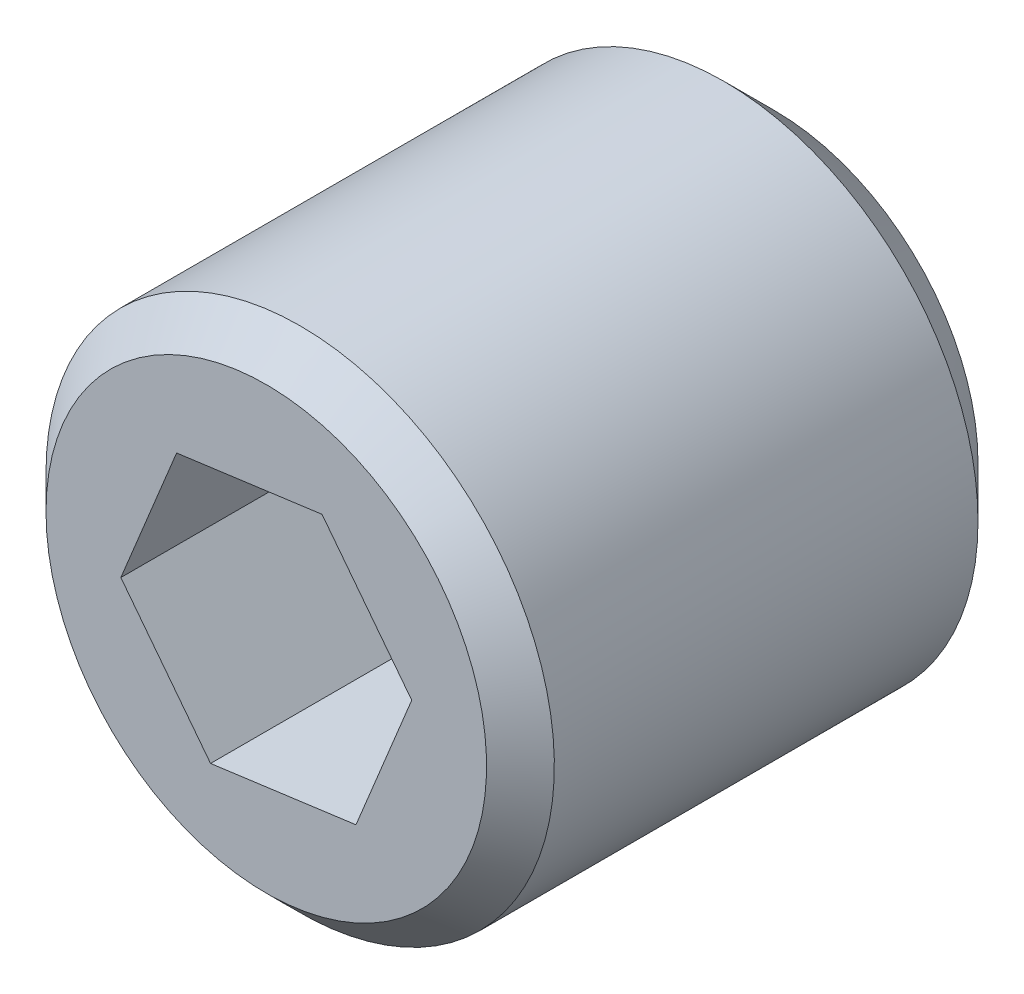
ISO-10303-21;
HEADER;
FILE_DESCRIPTION(('STEP AP214'),'2;1');
FILE_NAME('part.step','',(''),(''),'','','');
FILE_SCHEMA(('AUTOMOTIVE_DESIGN { 1 0 10303 214 1 1 1 1 }'));
ENDSEC;
DATA;
#1=APPLICATION_CONTEXT('core data for automotive mechanical design processes');
#2=APPLICATION_PROTOCOL_DEFINITION('international standard','automotive_design',2000,#1);
#3=PRODUCT_CONTEXT('',#1,'mechanical');
#4=PRODUCT('Part','Part','',(#3));
#5=PRODUCT_RELATED_PRODUCT_CATEGORY('part','',(#4));
#6=PRODUCT_DEFINITION_FORMATION('','',#4);
#7=PRODUCT_DEFINITION_CONTEXT('part definition',#1,'design');
#8=PRODUCT_DEFINITION('design','',#6,#7);
#9=PRODUCT_DEFINITION_SHAPE('','',#8);
#10=(LENGTH_UNIT() NAMED_UNIT(*) SI_UNIT(.MILLI.,.METRE.));
#11=(NAMED_UNIT(*) PLANE_ANGLE_UNIT() SI_UNIT($,.RADIAN.));
#12=(NAMED_UNIT(*) SI_UNIT($,.STERADIAN.) SOLID_ANGLE_UNIT());
#13=UNCERTAINTY_MEASURE_WITH_UNIT(LENGTH_MEASURE(1.E-05),#10,'distance_accuracy_value','');
#14=(GEOMETRIC_REPRESENTATION_CONTEXT(3) GLOBAL_UNCERTAINTY_ASSIGNED_CONTEXT((#13)) GLOBAL_UNIT_ASSIGNED_CONTEXT((#10,
#11,#12)) REPRESENTATION_CONTEXT('',''));
#15=CARTESIAN_POINT('',(0.,0.,0.));
#16=DIRECTION('',(0.,0.,1.));
#17=DIRECTION('',(1.,0.,0.));
#18=AXIS2_PLACEMENT_3D('',#15,#16,#17);
#19=CARTESIAN_POINT('',(-0.216609,-10.0653,143.246179594939));
#20=DIRECTION('',(0.,0.,1.));
#21=DIRECTION('',(1.,0.,0.));
#22=AXIS2_PLACEMENT_3D('',#19,#20,#21);
#23=CONICAL_SURFACE('',#22,0.871221663015082,1.22172999986979);
#24=CARTESIAN_POINT('',(-1.0748781925244,-10.1809459820458,143.244288308446));
#25=CARTESIAN_POINT('',(-1.06125431292545,-10.1477704203502,143.237759434665));
#26=CARTESIAN_POINT('',(-1.04758551035089,-10.1144854665435,143.231820315478));
#27=CARTESIAN_POINT('',(-1.02015903742311,-10.0476991566601,143.221371381029));
#28=CARTESIAN_POINT('',(-1.00640130608111,-10.0141976520693,143.216862683983));
#29=CARTESIAN_POINT('',(-0.978949640261533,-9.94734999487793,143.209570006385));
#30=CARTESIAN_POINT('',(-0.965256332591143,-9.91400536861803,143.206770120815));
#31=CARTESIAN_POINT('',(-0.937837698502683,-9.8472381471224,143.203014689557));
#32=CARTESIAN_POINT('',(-0.924112386021839,-9.81381558582527,143.202058452436));
#33=CARTESIAN_POINT('',(-0.896661761060151,-9.74697046323101,143.202058452436));
#34=CARTESIAN_POINT('',(-0.882936448579307,-9.71354790193387,143.203014689557));
#35=CARTESIAN_POINT('',(-0.855517814490847,-9.64678068043825,143.206770120815));
#36=CARTESIAN_POINT('',(-0.841824506820456,-9.61343605417835,143.209570006385));
#37=CARTESIAN_POINT('',(-0.814372841000876,-9.54658839698702,143.216862683983));
#38=CARTESIAN_POINT('',(-0.800615109658877,-9.5130868923962,143.221371381029));
#39=CARTESIAN_POINT('',(-0.77318863673109,-9.44630058251273,143.231820315477));
#40=CARTESIAN_POINT('',(-0.759519834156534,-9.4130156287061,143.237759434664));
#41=CARTESIAN_POINT('',(-0.745895954557587,-9.37984006701043,143.244288308445));
#42=B_SPLINE_CURVE_WITH_KNOTS('',3,(#24,#25,#26,#27,#28,#29,#30,#31,#32,#33,#34,#35,#36,#37,#38,
#39,#40,#41),.UNSPECIFIED.,.F.,.F.,(4,2,2,2,2,2,2,2,4),(0.,0.109371635123955,0.218828560696517,
0.327250511791547,0.435631792929203,0.544013074066857,0.652435025161883,0.761891950734451,
0.871263585858409),.UNSPECIFIED.);
#43=CARTESIAN_POINT('',(-1.07487819254782,-10.1809459820409,143.244288308454));
#44=VERTEX_POINT('',#43);
#45=CARTESIAN_POINT('',(-0.74589595455647,-9.37984006700973,143.244288308445));
#46=VERTEX_POINT('',#45);
#47=EDGE_CURVE('E127',#44,#46,#42,.T.);
#48=ORIENTED_EDGE('',*,*,#47,.F.);
#49=CARTESIAN_POINT('',(-0.545591237965808,-10.8664059150302,143.244288308444));
#50=CARTESIAN_POINT('',(-0.567510177379705,-10.8380195083514,143.237759434663));
#51=CARTESIAN_POINT('',(-0.58950139165287,-10.8095395011789,143.231820315476));
#52=CARTESIAN_POINT('',(-0.633626796173292,-10.752394323945,143.221371381028));
#53=CARTESIAN_POINT('',(-0.655761084543052,-10.7237290268087,143.216862683982));
#54=CARTESIAN_POINT('',(-0.699927020944636,-10.6665313582365,143.209570006383));
#55=CARTESIAN_POINT('',(-0.721957660530318,-10.6380002928019,143.206770120814));
#56=CARTESIAN_POINT('',(-0.766070453441611,-10.5808714483959,143.203014689556));
#57=CARTESIAN_POINT('',(-0.788152584344152,-10.5522736984638,143.202058452434));
#58=CARTESIAN_POINT('',(-0.832316846149229,-10.4950781985995,143.202058452435));
#59=CARTESIAN_POINT('',(-0.854398977051764,-10.4664804486674,143.203014689556));
#60=CARTESIAN_POINT('',(-0.898511769963041,-10.4093516042614,143.206770120814));
#61=CARTESIAN_POINT('',(-0.920542409548713,-10.3808205388268,143.209570006384));
#62=CARTESIAN_POINT('',(-0.964708345950273,-10.3236228702547,143.216862683983));
#63=CARTESIAN_POINT('',(-0.98684263432002,-10.2949575731185,143.221371381029));
#64=CARTESIAN_POINT('',(-1.03096803884042,-10.2378123958846,143.231820315478));
#65=CARTESIAN_POINT('',(-1.05295925311357,-10.2093323887121,143.237759434665));
#66=CARTESIAN_POINT('',(-1.07487819252745,-10.1809459820332,143.244288308446));
#67=B_SPLINE_CURVE_WITH_KNOTS('',3,(#49,#50,#51,#52,#53,#54,#55,#56,#57,#58,#59,#60,#61,#62,#63,
#64,#65,#66),.UNSPECIFIED.,.F.,.F.,(4,2,2,2,2,2,2,2,4),(0.,0.109371635124787,0.218828560698181,
0.327250511794016,0.435631792932479,0.544013074070927,0.652435025166747,0.761891950740136,
0.871263585864916),.UNSPECIFIED.);
#68=CARTESIAN_POINT('',(-0.545591237965233,-10.8664059150316,143.244288308445));
#69=VERTEX_POINT('',#68);
#70=EDGE_CURVE('E116',#69,#44,#67,.T.);
#71=ORIENTED_EDGE('',*,*,#70,.F.);
#72=CARTESIAN_POINT('',(0.312677954555563,-10.7507599329902,143.244288308445));
#73=CARTESIAN_POINT('',(0.27713513554306,-10.7555490880072,143.237759434664));
#74=CARTESIAN_POINT('',(0.241475118695687,-10.7603540346415,143.231820315477));
#75=CARTESIAN_POINT('',(0.169923241248183,-10.7699951672914,143.221371381029));
#76=CARTESIAN_POINT('',(0.13403122153678,-10.7748313747462,143.216862683983));
#77=CARTESIAN_POINT('',(0.0624136193163191,-10.7844813633657,143.209570006385));
#78=CARTESIAN_POINT('',(0.0266896720605924,-10.7892949241912,143.206770120815));
#79=CARTESIAN_POINT('',(-0.0448417549384666,-10.7989333012812,143.203014689557));
#80=CARTESIAN_POINT('',(-0.080649198321504,-10.8037581126464,143.202058452436));
#81=CARTESIAN_POINT('',(-0.15226408508758,-10.8134077353768,143.202058452436));
#82=CARTESIAN_POINT('',(-0.188071528470618,-10.818232546742,143.203014689557));
#83=CARTESIAN_POINT('',(-0.259602955469678,-10.827870923832,143.206770120815));
#84=CARTESIAN_POINT('',(-0.295326902725405,-10.8326844846575,143.209570006385));
#85=CARTESIAN_POINT('',(-0.366944504945868,-10.842334473277,143.216862683983));
#86=CARTESIAN_POINT('',(-0.402836524657273,-10.8471706807318,143.221371381029));
#87=CARTESIAN_POINT('',(-0.474388402104779,-10.8568118133817,143.231820315477));
#88=CARTESIAN_POINT('',(-0.510048418952153,-10.861616760016,143.237759434664));
#89=CARTESIAN_POINT('',(-0.545591237964658,-10.866405915033,143.244288308445));
#90=B_SPLINE_CURVE_WITH_KNOTS('',3,(#72,#73,#74,#75,#76,#77,#78,#79,#80,#81,#82,#83,#84,#85,#86,
#87,#88,#89),.UNSPECIFIED.,.F.,.F.,(4,2,2,2,2,2,2,2,4),(0.,0.109371635123184,0.218828560694977,
0.32725051178925,0.435631792926152,0.544013074063055,0.652435025157327,0.76189195072912,
0.871263585852304),.UNSPECIFIED.);
#91=CARTESIAN_POINT('',(0.312677954555834,-10.7507599329899,143.244288308445));
#92=VERTEX_POINT('',#91);
#93=EDGE_CURVE('E20',#92,#69,#90,.T.);
#94=ORIENTED_EDGE('',*,*,#93,.F.);
#95=CARTESIAN_POINT('',(0.641660192522805,-9.94965401795747,143.244288308445));
#96=CARTESIAN_POINT('',(0.628036312923876,-9.98282957965297,143.237759434664));
#97=CARTESIAN_POINT('',(0.614367510349339,-10.0161145334594,143.231820315477));
#98=CARTESIAN_POINT('',(0.586941037421592,-10.0829008433426,143.221371381029));
#99=CARTESIAN_POINT('',(0.573183306079613,-10.1164023479332,143.216862683983));
#100=CARTESIAN_POINT('',(0.545731640260072,-10.1832500051242,143.209570006384));
#101=CARTESIAN_POINT('',(0.532038332589701,-10.2165946313839,143.206770120814));
#102=CARTESIAN_POINT('',(0.504619698501278,-10.2833618528792,143.203014689556));
#103=CARTESIAN_POINT('',(0.490894386020452,-10.3167844141762,143.202058452435));
#104=CARTESIAN_POINT('',(0.463443761058801,-10.3836295367701,143.202058452435));
#105=CARTESIAN_POINT('',(0.449718448577976,-10.4170520980671,143.203014689556));
#106=CARTESIAN_POINT('',(0.422299814489554,-10.4838193195623,143.206770120814));
#107=CARTESIAN_POINT('',(0.408606506819183,-10.5171639458221,143.209570006384));
#108=CARTESIAN_POINT('',(0.381154840999643,-10.5840116030131,143.216862683983));
#109=CARTESIAN_POINT('',(0.367397109657665,-10.6175131076037,143.221371381029));
#110=CARTESIAN_POINT('',(0.339970636729919,-10.6842994174868,143.231820315477));
#111=CARTESIAN_POINT('',(0.326301834155381,-10.7175843712933,143.237759434664));
#112=CARTESIAN_POINT('',(0.312677954556452,-10.7507599329888,143.244288308445));
#113=B_SPLINE_CURVE_WITH_KNOTS('',3,(#95,#96,#97,#98,#99,#100,#101,#102,#103,#104,#105,#106,
#107,#108,#109,#110,#111,#112),.UNSPECIFIED.,.F.,.F.,(4,2,2,2,2,2,2,2,4),(0.,0.109371635123448,
0.218828560695504,0.327250511790039,0.435631792927202,0.544013074064363,0.652435025158893,
0.761891950730948,0.871263585854398),.UNSPECIFIED.);
#114=CARTESIAN_POINT('',(0.641660192523404,-9.94965401795723,143.244288308445));
#115=VERTEX_POINT('',#114);
#116=EDGE_CURVE('E160',#115,#92,#113,.T.);
#117=ORIENTED_EDGE('',*,*,#116,.F.);
#118=CARTESIAN_POINT('',(0.112373237967538,-9.26419408496669,143.244288308446));
#119=CARTESIAN_POINT('',(0.134292177381183,-9.29258049164525,143.237759434665));
#120=CARTESIAN_POINT('',(0.156283391654093,-9.32106049881739,143.231820315478));
#121=CARTESIAN_POINT('',(0.200408796174002,-9.37820567605065,143.221371381029));
#122=CARTESIAN_POINT('',(0.222543084543503,-9.40687097318661,143.216862683983));
#123=CARTESIAN_POINT('',(0.266709020944575,-9.4640686417581,143.209570006385));
#124=CARTESIAN_POINT('',(0.288739660530005,-9.49259970719238,143.206770120815));
#125=CARTESIAN_POINT('',(0.332852453440793,-9.54972855159774,143.203014689557));
#126=CARTESIAN_POINT('',(0.354934584343083,-9.57832630152954,143.202058452436));
#127=CARTESIAN_POINT('',(0.399098846147664,-9.63552180139312,143.202058452436));
#128=CARTESIAN_POINT('',(0.421180977049954,-9.66411955132492,143.203014689557));
#129=CARTESIAN_POINT('',(0.465293769960747,-9.72124839573029,143.206770120815));
#130=CARTESIAN_POINT('',(0.487324409546179,-9.74977946116457,143.209570006385));
#131=CARTESIAN_POINT('',(0.531490345947257,-9.80697712973607,143.216862683983));
#132=CARTESIAN_POINT('',(0.553624634316762,-9.83564242687203,143.221371381029));
#133=CARTESIAN_POINT('',(0.597750038836677,-9.89278760410531,143.231820315477));
#134=CARTESIAN_POINT('',(0.619741253109589,-9.92126761127744,143.237759434664));
#135=CARTESIAN_POINT('',(0.641660192523238,-9.94965401795601,143.244288308445));
#136=B_SPLINE_CURVE_WITH_KNOTS('',3,(#118,#119,#120,#121,#122,#123,#124,#125,#126,#127,#128,
#129,#130,#131,#132,#133,#134,#135),.UNSPECIFIED.,.F.,.F.,(4,2,2,2,2,2,2,2,4),(0.,
0.109371635123523,0.218828560695651,0.327250511790259,0.435631792927495,0.544013074064732,
0.652435025159343,0.76189195073148,0.871263585854998),.UNSPECIFIED.);
#137=CARTESIAN_POINT('',(0.11237323796683,-9.2641940849668,143.244288308445));
#138=VERTEX_POINT('',#137);
#139=EDGE_CURVE('E142',#138,#115,#136,.T.);
#140=ORIENTED_EDGE('',*,*,#139,.F.);
#141=CARTESIAN_POINT('',(-0.745895954555732,-9.37984006700996,143.244288308445));
#142=CARTESIAN_POINT('',(-0.710353135543191,-9.37505091199298,143.237759434664));
#143=CARTESIAN_POINT('',(-0.67469311869578,-9.37024596535861,143.231820315477));
#144=CARTESIAN_POINT('',(-0.603141241248194,-9.36060483270869,143.221371381029));
#145=CARTESIAN_POINT('',(-0.567249221536748,-9.35576862525396,143.216862683983));
#146=CARTESIAN_POINT('',(-0.495631619316204,-9.34611863663439,143.209570006385));
#147=CARTESIAN_POINT('',(-0.459907672060437,-9.3413050758089,143.206770120815));
#148=CARTESIAN_POINT('',(-0.388376245061295,-9.3316666987189,143.203014689557));
#149=CARTESIAN_POINT('',(-0.352568801678215,-9.32684188735369,143.202058452436));
#150=CARTESIAN_POINT('',(-0.280953914912055,-9.31719226462327,143.202058452436));
#151=CARTESIAN_POINT('',(-0.245146471528976,-9.31236745325807,143.203014689557));
#152=CARTESIAN_POINT('',(-0.173615044529834,-9.30272907616806,143.206770120815));
#153=CARTESIAN_POINT('',(-0.137891097274067,-9.29791551534258,143.209570006385));
#154=CARTESIAN_POINT('',(-0.0662734950535236,-9.28826552672301,143.216862683983));
#155=CARTESIAN_POINT('',(-0.0303814753420776,-9.28342931926828,143.221371381029));
#156=CARTESIAN_POINT('',(0.0411704021055082,-9.27378818661835,143.231820315477));
#157=CARTESIAN_POINT('',(0.0768304189529203,-9.26898323998398,143.237759434664));
#158=CARTESIAN_POINT('',(0.112373237965461,-9.264194084967,143.244288308445));
#159=B_SPLINE_CURVE_WITH_KNOTS('',3,(#141,#142,#143,#144,#145,#146,#147,#148,#149,#150,#151,
#152,#153,#154,#155,#156,#157,#158),.UNSPECIFIED.,.F.,.F.,(4,2,2,2,2,2,2,2,4),(0.,
0.109371635123305,0.218828560695224,0.327250511789623,0.435631792926651,0.544013074063679,
0.652435025158078,0.761891950729996,0.871263585853302),.UNSPECIFIED.);
#160=EDGE_CURVE('E135',#46,#138,#159,.T.);
#161=ORIENTED_EDGE('',*,*,#160,.F.);
#162=EDGE_LOOP('',(#48,#71,#94,#117,#140,#161));
#163=FACE_BOUND('',#162,.T.);
#164=CARTESIAN_POINT('',(-0.216609,-10.0653,142.929080371996));
#165=VERTEX_POINT('',#164);
#166=VERTEX_LOOP('',#165);
#167=FACE_BOUND('',#166,.T.);
#168=ADVANCED_FACE('F16',(#163,#167),#23,.F.);
#169=CARTESIAN_POINT('',(0.312677954557,-10.75075993299,152.63));
#170=DIRECTION('',(-0.133536477726964,0.991043898682735,0.));
#171=DIRECTION('',(-0.991043898682735,-0.133536477726964,0.));
#172=AXIS2_PLACEMENT_3D('',#169,#170,#171);
#173=PLANE('',#172);
#174=ORIENTED_EDGE('',*,*,#93,.T.);
#175=DIRECTION('',(0.,0.,1.));
#176=VECTOR('',#175,1.);
#177=CARTESIAN_POINT('',(-0.545591237966,-10.86640591503,152.63));
#178=LINE('',#177,#176);
#179=CARTESIAN_POINT('',(-0.54559123796558,-10.8664059150305,144.63));
#180=VERTEX_POINT('',#179);
#181=EDGE_CURVE('E124',#180,#69,#178,.F.);
#182=ORIENTED_EDGE('',*,*,#181,.F.);
#183=DIRECTION('',(0.991043898683224,0.133536477723335,0.));
#184=VECTOR('',#183,1.);
#185=CARTESIAN_POINT('',(-0.545591237966,-10.86640591503,144.63));
#186=LINE('',#185,#184);
#187=CARTESIAN_POINT('',(0.312677954556633,-10.7507599329899,144.63));
#188=VERTEX_POINT('',#187);
#189=EDGE_CURVE('E203',#180,#188,#186,.T.);
#190=ORIENTED_EDGE('',*,*,#189,.T.);
#191=DIRECTION('',(0.,0.,1.));
#192=VECTOR('',#191,1.);
#193=CARTESIAN_POINT('',(0.312677954556107,-10.7507599329896,152.63));
#194=LINE('',#193,#192);
#195=EDGE_CURVE('E165',#92,#188,#194,.T.);
#196=ORIENTED_EDGE('',*,*,#195,.F.);
#197=EDGE_LOOP('',(#174,#182,#190,#196));
#198=FACE_BOUND('',#197,.T.);
#199=ADVANCED_FACE('F73',(#198),#173,.T.);
#200=CARTESIAN_POINT('',(0.641660192523,-9.949654017957,152.63));
#201=DIRECTION('',(-0.925037431388231,0.379875967298095,0.));
#202=DIRECTION('',(-0.379875967298095,-0.925037431388231,0.));
#203=AXIS2_PLACEMENT_3D('',#200,#201,#202);
#204=PLANE('',#203);
#205=ORIENTED_EDGE('',*,*,#116,.T.);
#206=ORIENTED_EDGE('',*,*,#195,.T.);
#207=DIRECTION('',(0.379875967297469,0.925037431388488,0.));
#208=VECTOR('',#207,1.);
#209=CARTESIAN_POINT('',(0.312677954557,-10.75075993299,144.63));
#210=LINE('',#209,#208);
#211=CARTESIAN_POINT('',(0.641660192523438,-9.94965401795742,144.63));
#212=VERTEX_POINT('',#211);
#213=EDGE_CURVE('E205',#188,#212,#210,.T.);
#214=ORIENTED_EDGE('',*,*,#213,.T.);
#215=DIRECTION('',(0.,0.,1.));
#216=VECTOR('',#215,1.);
#217=CARTESIAN_POINT('',(0.641660192524003,-9.949654017957,152.63));
#218=LINE('',#217,#216);
#219=EDGE_CURVE('E141',#115,#212,#218,.T.);
#220=ORIENTED_EDGE('',*,*,#219,.F.);
#221=EDGE_LOOP('',(#205,#206,#214,#220));
#222=FACE_BOUND('',#221,.T.);
#223=ADVANCED_FACE('F79',(#222),#204,.T.);
#224=CARTESIAN_POINT('',(0.112373237967,-9.264194084966,152.63));
#225=DIRECTION('',(-0.791500953661979,-0.611167931383984,0.));
#226=DIRECTION('',(0.611167931383984,-0.791500953661979,0.));
#227=AXIS2_PLACEMENT_3D('',#224,#225,#226);
#228=PLANE('',#227);
#229=ORIENTED_EDGE('',*,*,#139,.T.);
#230=ORIENTED_EDGE('',*,*,#219,.T.);
#231=DIRECTION('',(-0.611167931382699,0.791500953662971,0.));
#232=VECTOR('',#231,1.);
#233=CARTESIAN_POINT('',(0.641660192523,-9.949654017958,144.63));
#234=LINE('',#233,#232);
#235=CARTESIAN_POINT('',(0.112373237966439,-9.26419408496647,144.63));
#236=VERTEX_POINT('',#235);
#237=EDGE_CURVE('E209',#212,#236,#234,.T.);
#238=ORIENTED_EDGE('',*,*,#237,.T.);
#239=DIRECTION('',(0.,0.,1.));
#240=VECTOR('',#239,1.);
#241=CARTESIAN_POINT('',(0.112373237966124,-9.26419408496692,152.63));
#242=LINE('',#241,#240);
#243=EDGE_CURVE('E134',#138,#236,#242,.T.);
#244=ORIENTED_EDGE('',*,*,#243,.F.);
#245=EDGE_LOOP('',(#229,#230,#238,#244));
#246=FACE_BOUND('',#245,.T.);
#247=ADVANCED_FACE('F150',(#246),#228,.T.);
#248=CARTESIAN_POINT('',(-0.745895954556,-9.37984006701,152.63));
#249=DIRECTION('',(0.133536477726964,-0.991043898682735,0.));
#250=DIRECTION('',(0.991043898682735,0.133536477726964,0.));
#251=AXIS2_PLACEMENT_3D('',#248,#249,#250);
#252=PLANE('',#251);
#253=ORIENTED_EDGE('',*,*,#160,.T.);
#254=ORIENTED_EDGE('',*,*,#243,.T.);
#255=DIRECTION('',(-0.991043898682613,-0.13353647772787,0.));
#256=VECTOR('',#255,1.);
#257=CARTESIAN_POINT('',(0.112373237967,-9.264194084966,144.63));
#258=LINE('',#257,#256);
#259=CARTESIAN_POINT('',(-0.745895954556603,-9.37984006700975,144.63));
#260=VERTEX_POINT('',#259);
#261=EDGE_CURVE('E197',#236,#260,#258,.T.);
#262=ORIENTED_EDGE('',*,*,#261,.T.);
#263=DIRECTION('',(0.,0.,1.));
#264=VECTOR('',#263,1.);
#265=CARTESIAN_POINT('',(-0.745895954557205,-9.37984006700951,152.63));
#266=LINE('',#265,#264);
#267=EDGE_CURVE('E133',#46,#260,#266,.T.);
#268=ORIENTED_EDGE('',*,*,#267,.F.);
#269=EDGE_LOOP('',(#253,#254,#262,#268));
#270=FACE_BOUND('',#269,.T.);
#271=ADVANCED_FACE('F147',(#270),#252,.T.);
#272=CARTESIAN_POINT('',(-1.074878192522,-10.18094598204,152.63));
#273=DIRECTION('',(0.925037431388727,-0.379875967296888,0.));
#274=DIRECTION('',(0.379875967296888,0.925037431388727,0.));
#275=AXIS2_PLACEMENT_3D('',#272,#273,#274);
#276=PLANE('',#275);
#277=ORIENTED_EDGE('',*,*,#47,.T.);
#278=ORIENTED_EDGE('',*,*,#267,.T.);
#279=DIRECTION('',(-0.37987596729828,-0.925037431388155,0.));
#280=VECTOR('',#279,1.);
#281=CARTESIAN_POINT('',(-0.745895954556,-9.37984006701,144.63));
#282=LINE('',#281,#280);
#283=CARTESIAN_POINT('',(-1.07487819252214,-10.1809459820401,144.63));
#284=VERTEX_POINT('',#283);
#285=EDGE_CURVE('E38',#260,#284,#282,.T.);
#286=ORIENTED_EDGE('',*,*,#285,.T.);
#287=DIRECTION('',(0.,0.,1.));
#288=VECTOR('',#287,1.);
#289=CARTESIAN_POINT('',(-1.07487819252214,-10.1809459820401,152.63));
#290=LINE('',#289,#288);
#291=EDGE_CURVE('E123',#44,#284,#290,.T.);
#292=ORIENTED_EDGE('',*,*,#291,.F.);
#293=EDGE_LOOP('',(#277,#278,#286,#292));
#294=FACE_BOUND('',#293,.T.);
#295=ADVANCED_FACE('F111',(#294),#276,.T.);
#296=CARTESIAN_POINT('',(-0.545591237966,-10.86640591503,152.63));
#297=DIRECTION('',(0.791500953661979,0.611167931383984,0.));
#298=DIRECTION('',(-0.611167931383984,0.791500953661979,0.));
#299=AXIS2_PLACEMENT_3D('',#296,#297,#298);
#300=PLANE('',#299);
#301=ORIENTED_EDGE('',*,*,#70,.T.);
#302=ORIENTED_EDGE('',*,*,#291,.T.);
#303=DIRECTION('',(0.611167931383816,-0.791500953662108,0.));
#304=VECTOR('',#303,1.);
#305=CARTESIAN_POINT('',(-1.074878192522,-10.18094598204,144.63));
#306=LINE('',#305,#304);
#307=EDGE_CURVE('E174',#284,#180,#306,.T.);
#308=ORIENTED_EDGE('',*,*,#307,.T.);
#309=ORIENTED_EDGE('',*,*,#181,.T.);
#310=EDGE_LOOP('',(#301,#302,#308,#309));
#311=FACE_BOUND('',#310,.T.);
#312=ADVANCED_FACE('F106',(#311),#300,.T.);
#313=CARTESIAN_POINT('',(-0.216609,-10.0653,144.63));
#314=DIRECTION('',(0.,0.,-1.));
#315=DIRECTION('',(0.,1.,0.));
#316=AXIS2_PLACEMENT_3D('',#313,#314,#315);
#317=PLANE('',#316);
#318=ORIENTED_EDGE('',*,*,#285,.F.);
#319=ORIENTED_EDGE('',*,*,#261,.F.);
#320=ORIENTED_EDGE('',*,*,#237,.F.);
#321=ORIENTED_EDGE('',*,*,#213,.F.);
#322=ORIENTED_EDGE('',*,*,#189,.F.);
#323=ORIENTED_EDGE('',*,*,#307,.F.);
#324=EDGE_LOOP('',(#318,#319,#320,#321,#322,#323));
#325=FACE_BOUND('',#324,.T.);
#326=CARTESIAN_POINT('',(-0.216609,-10.0653,144.630000000063));
#327=DIRECTION('',(0.,0.,-1.));
#328=DIRECTION('',(-1.,0.,0.));
#329=AXIS2_PLACEMENT_3D('',#326,#327,#328);
#330=CIRCLE('',#329,1.30000000000693);
#331=CARTESIAN_POINT('',(-1.51660900000693,-10.0653,144.630000000063));
#332=VERTEX_POINT('',#331);
#333=EDGE_CURVE('E125',#332,#332,#330,.T.);
#334=ORIENTED_EDGE('',*,*,#333,.F.);
#335=EDGE_LOOP('',(#334));
#336=FACE_BOUND('',#335,.T.);
#337=ADVANCED_FACE('F102',(#325,#336),#317,.F.);
#338=CARTESIAN_POINT('',(-0.216609,-10.0653,141.63));
#339=DIRECTION('',(0.,0.,-1.));
#340=DIRECTION('',(0.,1.,0.));
#341=AXIS2_PLACEMENT_3D('',#338,#339,#340);
#342=PLANE('',#341);
#343=CARTESIAN_POINT('',(-0.216609,-10.0653,141.629999999958));
#344=DIRECTION('',(0.,0.,1.));
#345=DIRECTION('',(1.,0.,0.));
#346=AXIS2_PLACEMENT_3D('',#343,#344,#345);
#347=CIRCLE('',#346,1.19999999996689);
#348=CARTESIAN_POINT('',(0.98339099996689,-10.0653,141.629999999958));
#349=VERTEX_POINT('',#348);
#350=EDGE_CURVE('E217',#349,#349,#347,.T.);
#351=ORIENTED_EDGE('',*,*,#350,.F.);
#352=EDGE_LOOP('',(#351));
#353=FACE_BOUND('',#352,.T.);
#354=ADVANCED_FACE('F98',(#353),#342,.T.);
#355=CARTESIAN_POINT('',(-0.216609,-10.0653,144.43));
#356=DIRECTION('',(0.,0.,-1.));
#357=DIRECTION('',(-1.,0.,0.));
#358=AXIS2_PLACEMENT_3D('',#355,#356,#357);
#359=CONICAL_SURFACE('',#358,1.5000000000205,0.785398163272682);
#360=ORIENTED_EDGE('',*,*,#333,.T.);
#361=EDGE_LOOP('',(#360));
#362=FACE_BOUND('',#361,.T.);
#363=CARTESIAN_POINT('',(-0.216609,-10.0653,144.43));
#364=DIRECTION('',(0.,0.,-1.));
#365=DIRECTION('',(0.,1.,0.));
#366=AXIS2_PLACEMENT_3D('',#363,#364,#365);
#367=CIRCLE('',#366,1.5);
#368=CARTESIAN_POINT('',(-0.216609,-8.5653,144.43));
#369=VERTEX_POINT('',#368);
#370=EDGE_CURVE('E29',#369,#369,#367,.T.);
#371=ORIENTED_EDGE('',*,*,#370,.F.);
#372=EDGE_LOOP('',(#371));
#373=FACE_BOUND('',#372,.T.);
#374=ADVANCED_FACE('F90',(#362,#373),#359,.T.);
#375=CARTESIAN_POINT('',(-0.216609,-10.0653,141.929999999888));
#376=DIRECTION('',(0.,0.,1.));
#377=DIRECTION('',(1.,0.,0.));
#378=AXIS2_PLACEMENT_3D('',#375,#376,#377);
#379=CONICAL_SURFACE('',#378,1.49999999990594,0.785398163412051);
#380=CARTESIAN_POINT('',(-0.216609,-10.0653,141.93));
#381=DIRECTION('',(0.,0.,-1.));
#382=DIRECTION('',(0.,1.,0.));
#383=AXIS2_PLACEMENT_3D('',#380,#381,#382);
#384=CIRCLE('',#383,1.5);
#385=CARTESIAN_POINT('',(-0.216609,-8.5653,141.93));
#386=VERTEX_POINT('',#385);
#387=EDGE_CURVE('E11',#386,#386,#384,.F.);
#388=ORIENTED_EDGE('',*,*,#387,.F.);
#389=EDGE_LOOP('',(#388));
#390=FACE_BOUND('',#389,.T.);
#391=ORIENTED_EDGE('',*,*,#350,.T.);
#392=EDGE_LOOP('',(#391));
#393=FACE_BOUND('',#392,.T.);
#394=ADVANCED_FACE('F84',(#390,#393),#379,.T.);
#395=CARTESIAN_POINT('',(-0.216609,-10.0653,144.63));
#396=DIRECTION('',(0.,0.,-1.));
#397=DIRECTION('',(0.,1.,0.));
#398=AXIS2_PLACEMENT_3D('',#395,#396,#397);
#399=CYLINDRICAL_SURFACE('',#398,1.5);
#400=ORIENTED_EDGE('',*,*,#370,.T.);
#401=EDGE_LOOP('',(#400));
#402=FACE_BOUND('',#401,.T.);
#403=ORIENTED_EDGE('',*,*,#387,.T.);
#404=EDGE_LOOP('',(#403));
#405=FACE_BOUND('',#404,.T.);
#406=ADVANCED_FACE('F82',(#402,#405),#399,.T.);
#407=CLOSED_SHELL('',(#168,#199,#223,#247,#271,#295,#312,#337,#354,#374,#394,#406));
#408=MANIFOLD_SOLID_BREP('B1',#407);
#409=ADVANCED_BREP_SHAPE_REPRESENTATION('',(#18,#408),#14);
#410=SHAPE_DEFINITION_REPRESENTATION(#9,#409);
ENDSEC;
END-ISO-10303-21;
